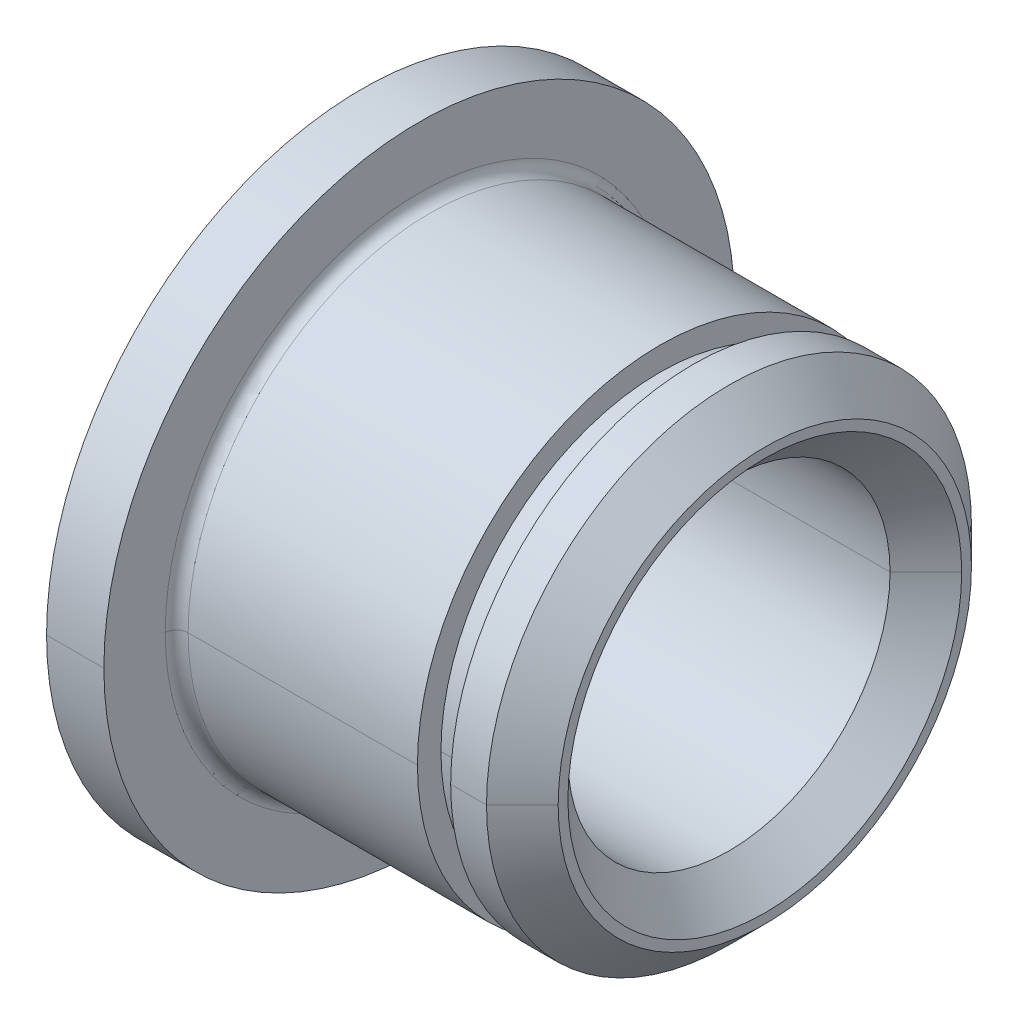
ISO-10303-21;
HEADER;
FILE_DESCRIPTION(('STEP AP214'),'2;1');
FILE_NAME('part.step','',(''),(''),'','','');
FILE_SCHEMA(('AUTOMOTIVE_DESIGN { 1 0 10303 214 1 1 1 1 }'));
ENDSEC;
DATA;
#1=APPLICATION_CONTEXT('core data for automotive mechanical design processes');
#2=APPLICATION_PROTOCOL_DEFINITION('international standard','automotive_design',2000,#1);
#3=PRODUCT_CONTEXT('',#1,'mechanical');
#4=PRODUCT('Part','Part','',(#3));
#5=PRODUCT_RELATED_PRODUCT_CATEGORY('part','',(#4));
#6=PRODUCT_DEFINITION_FORMATION('','',#4);
#7=PRODUCT_DEFINITION_CONTEXT('part definition',#1,'design');
#8=PRODUCT_DEFINITION('design','',#6,#7);
#9=PRODUCT_DEFINITION_SHAPE('','',#8);
#10=(LENGTH_UNIT() NAMED_UNIT(*) SI_UNIT(.MILLI.,.METRE.));
#11=(NAMED_UNIT(*) PLANE_ANGLE_UNIT() SI_UNIT($,.RADIAN.));
#12=(NAMED_UNIT(*) SI_UNIT($,.STERADIAN.) SOLID_ANGLE_UNIT());
#13=UNCERTAINTY_MEASURE_WITH_UNIT(LENGTH_MEASURE(1.E-05),#10,'distance_accuracy_value','');
#14=(GEOMETRIC_REPRESENTATION_CONTEXT(3) GLOBAL_UNCERTAINTY_ASSIGNED_CONTEXT((#13)) GLOBAL_UNIT_ASSIGNED_CONTEXT((#10,
#11,#12)) REPRESENTATION_CONTEXT('',''));
#15=CARTESIAN_POINT('',(0.,0.,0.));
#16=DIRECTION('',(0.,0.,1.));
#17=DIRECTION('',(1.,0.,0.));
#18=AXIS2_PLACEMENT_3D('',#15,#16,#17);
#19=CARTESIAN_POINT('',(0.,4.36245,0.));
#20=DIRECTION('',(1.,0.,0.));
#21=DIRECTION('',(0.,1.,0.));
#22=AXIS2_PLACEMENT_3D('',#19,#20,#21);
#23=PLANE('',#22);
#24=CARTESIAN_POINT('',(0.,0.,0.));
#25=DIRECTION('',(-1.,0.,0.));
#26=DIRECTION('',(0.,0.,1.));
#27=AXIS2_PLACEMENT_3D('',#24,#25,#26);
#28=CIRCLE('',#27,4.36245);
#29=CARTESIAN_POINT('',(0.,0.,4.36245));
#30=VERTEX_POINT('',#29);
#31=CARTESIAN_POINT('',(0.,0.,-4.36245));
#32=VERTEX_POINT('',#31);
#33=EDGE_CURVE('E37',#30,#32,#28,.T.);
#34=ORIENTED_EDGE('',*,*,#33,.F.);
#35=CARTESIAN_POINT('',(0.,0.,0.));
#36=DIRECTION('',(-1.,0.,0.));
#37=DIRECTION('',(0.,0.,1.));
#38=AXIS2_PLACEMENT_3D('',#35,#36,#37);
#39=CIRCLE('',#38,4.36245);
#40=EDGE_CURVE('E235',#32,#30,#39,.T.);
#41=ORIENTED_EDGE('',*,*,#40,.F.);
#42=EDGE_LOOP('',(#34,#41));
#43=FACE_BOUND('',#42,.T.);
#44=CARTESIAN_POINT('',(0.,0.,0.));
#45=DIRECTION('',(-1.,0.,0.));
#46=DIRECTION('',(0.,0.,1.));
#47=AXIS2_PLACEMENT_3D('',#44,#45,#46);
#48=CIRCLE('',#47,6.985);
#49=CARTESIAN_POINT('',(0.,0.,6.985));
#50=VERTEX_POINT('',#49);
#51=CARTESIAN_POINT('',(0.,0.,-6.985));
#52=VERTEX_POINT('',#51);
#53=EDGE_CURVE('E166',#50,#52,#48,.T.);
#54=ORIENTED_EDGE('',*,*,#53,.T.);
#55=CARTESIAN_POINT('',(0.,0.,0.));
#56=DIRECTION('',(-1.,0.,0.));
#57=DIRECTION('',(0.,0.,1.));
#58=AXIS2_PLACEMENT_3D('',#55,#56,#57);
#59=CIRCLE('',#58,6.985);
#60=EDGE_CURVE('E10',#52,#50,#59,.T.);
#61=ORIENTED_EDGE('',*,*,#60,.T.);
#62=EDGE_LOOP('',(#54,#61));
#63=FACE_BOUND('',#62,.T.);
#64=ADVANCED_FACE('F16',(#43,#63),#23,.F.);
#65=CARTESIAN_POINT('',(0.,0.,0.));
#66=DIRECTION('',(-1.,0.,0.));
#67=DIRECTION('',(0.,0.,1.));
#68=AXIS2_PLACEMENT_3D('',#65,#66,#67);
#69=CYLINDRICAL_SURFACE('',#68,6.985);
#70=DIRECTION('',(-1.,0.,0.));
#71=VECTOR('',#70,1.);
#72=CARTESIAN_POINT('',(0.,0.,-6.985));
#73=LINE('',#72,#71);
#74=CARTESIAN_POINT('',(1.27,0.,-6.985));
#75=VERTEX_POINT('',#74);
#76=EDGE_CURVE('E156',#75,#52,#73,.T.);
#77=ORIENTED_EDGE('',*,*,#76,.F.);
#78=CARTESIAN_POINT('',(1.27,0.,0.));
#79=DIRECTION('',(-1.,0.,0.));
#80=DIRECTION('',(0.,0.,1.));
#81=AXIS2_PLACEMENT_3D('',#78,#79,#80);
#82=CIRCLE('',#81,6.985);
#83=CARTESIAN_POINT('',(1.27,0.,6.985));
#84=VERTEX_POINT('',#83);
#85=EDGE_CURVE('E25',#75,#84,#82,.T.);
#86=ORIENTED_EDGE('',*,*,#85,.T.);
#87=DIRECTION('',(-1.,0.,0.));
#88=VECTOR('',#87,1.);
#89=CARTESIAN_POINT('',(0.,0.,6.985));
#90=LINE('',#89,#88);
#91=EDGE_CURVE('E153',#84,#50,#90,.T.);
#92=ORIENTED_EDGE('',*,*,#91,.T.);
#93=ORIENTED_EDGE('',*,*,#60,.F.);
#94=EDGE_LOOP('',(#77,#86,#92,#93));
#95=FACE_BOUND('',#94,.T.);
#96=ADVANCED_FACE('F18',(#95),#69,.T.);
#97=CARTESIAN_POINT('',(1.27,6.985,0.));
#98=DIRECTION('',(-1.,0.,0.));
#99=DIRECTION('',(0.,0.,1.));
#100=AXIS2_PLACEMENT_3D('',#97,#98,#99);
#101=PLANE('',#100);
#102=CARTESIAN_POINT('',(1.27,0.,0.));
#103=DIRECTION('',(-1.,0.,0.));
#104=DIRECTION('',(0.,0.,1.));
#105=AXIS2_PLACEMENT_3D('',#102,#103,#104);
#106=CIRCLE('',#105,5.6261);
#107=CARTESIAN_POINT('',(1.27,0.,5.6261));
#108=VERTEX_POINT('',#107);
#109=CARTESIAN_POINT('',(1.27,0.,-5.6261));
#110=VERTEX_POINT('',#109);
#111=EDGE_CURVE('E161',#108,#110,#106,.T.);
#112=ORIENTED_EDGE('',*,*,#111,.T.);
#113=CARTESIAN_POINT('',(1.27,0.,0.));
#114=DIRECTION('',(-1.,0.,0.));
#115=DIRECTION('',(0.,0.,1.));
#116=AXIS2_PLACEMENT_3D('',#113,#114,#115);
#117=CIRCLE('',#116,5.6261);
#118=EDGE_CURVE('E168',#110,#108,#117,.T.);
#119=ORIENTED_EDGE('',*,*,#118,.T.);
#120=EDGE_LOOP('',(#112,#119));
#121=FACE_BOUND('',#120,.T.);
#122=CARTESIAN_POINT('',(1.27,0.,0.));
#123=DIRECTION('',(-1.,0.,0.));
#124=DIRECTION('',(0.,0.,1.));
#125=AXIS2_PLACEMENT_3D('',#122,#123,#124);
#126=CIRCLE('',#125,6.985);
#127=EDGE_CURVE('E164',#84,#75,#126,.T.);
#128=ORIENTED_EDGE('',*,*,#127,.F.);
#129=ORIENTED_EDGE('',*,*,#85,.F.);
#130=EDGE_LOOP('',(#128,#129));
#131=FACE_BOUND('',#130,.T.);
#132=ADVANCED_FACE('F170',(#121,#131),#101,.F.);
#133=CARTESIAN_POINT('',(1.524,0.,0.));
#134=DIRECTION('',(-1.,0.,0.));
#135=DIRECTION('',(0.,0.,1.));
#136=AXIS2_PLACEMENT_3D('',#133,#134,#135);
#137=TOROIDAL_SURFACE('',#136,5.6261,0.254);
#138=CARTESIAN_POINT('',(1.524,0.,-5.6261));
#139=DIRECTION('',(0.,1.,0.));
#140=DIRECTION('',(0.,0.,1.));
#141=AXIS2_PLACEMENT_3D('',#138,#139,#140);
#142=CIRCLE('',#141,0.254);
#143=CARTESIAN_POINT('',(1.524,0.,-5.3721));
#144=VERTEX_POINT('',#143);
#145=EDGE_CURVE('E181',#110,#144,#142,.T.);
#146=ORIENTED_EDGE('',*,*,#145,.F.);
#147=ORIENTED_EDGE('',*,*,#111,.F.);
#148=CARTESIAN_POINT('',(1.524,0.,5.6261));
#149=DIRECTION('',(0.,-1.,0.));
#150=DIRECTION('',(0.,0.,-1.));
#151=AXIS2_PLACEMENT_3D('',#148,#149,#150);
#152=CIRCLE('',#151,0.254);
#153=CARTESIAN_POINT('',(1.524,0.,5.3721));
#154=VERTEX_POINT('',#153);
#155=EDGE_CURVE('E202',#108,#154,#152,.T.);
#156=ORIENTED_EDGE('',*,*,#155,.T.);
#157=CARTESIAN_POINT('',(1.524,0.,0.));
#158=DIRECTION('',(-1.,0.,0.));
#159=DIRECTION('',(0.,0.,1.));
#160=AXIS2_PLACEMENT_3D('',#157,#158,#159);
#161=CIRCLE('',#160,5.3721);
#162=EDGE_CURVE('E224',#154,#144,#161,.T.);
#163=ORIENTED_EDGE('',*,*,#162,.T.);
#164=EDGE_LOOP('',(#146,#147,#156,#163));
#165=FACE_BOUND('',#164,.T.);
#166=ADVANCED_FACE('F329',(#165),#137,.F.);
#167=CARTESIAN_POINT('',(0.,0.,0.));
#168=DIRECTION('',(-1.,0.,0.));
#169=DIRECTION('',(0.,0.,1.));
#170=AXIS2_PLACEMENT_3D('',#167,#168,#169);
#171=CYLINDRICAL_SURFACE('',#170,5.3721);
#172=DIRECTION('',(-1.,0.,0.));
#173=VECTOR('',#172,1.);
#174=CARTESIAN_POINT('',(0.,0.,-5.3721));
#175=LINE('',#174,#173);
#176=CARTESIAN_POINT('',(6.604,0.,-5.3721));
#177=VERTEX_POINT('',#176);
#178=EDGE_CURVE('E214',#177,#144,#175,.T.);
#179=ORIENTED_EDGE('',*,*,#178,.F.);
#180=CARTESIAN_POINT('',(6.604,0.,0.));
#181=DIRECTION('',(-1.,0.,0.));
#182=DIRECTION('',(0.,0.,1.));
#183=AXIS2_PLACEMENT_3D('',#180,#181,#182);
#184=CIRCLE('',#183,5.3721);
#185=CARTESIAN_POINT('',(6.604,0.,5.3721));
#186=VERTEX_POINT('',#185);
#187=EDGE_CURVE('E318',#177,#186,#184,.T.);
#188=ORIENTED_EDGE('',*,*,#187,.T.);
#189=DIRECTION('',(-1.,0.,0.));
#190=VECTOR('',#189,1.);
#191=CARTESIAN_POINT('',(0.,0.,5.3721));
#192=LINE('',#191,#190);
#193=EDGE_CURVE('E229',#186,#154,#192,.T.);
#194=ORIENTED_EDGE('',*,*,#193,.T.);
#195=CARTESIAN_POINT('',(1.524,0.,0.));
#196=DIRECTION('',(-1.,0.,0.));
#197=DIRECTION('',(0.,0.,1.));
#198=AXIS2_PLACEMENT_3D('',#195,#196,#197);
#199=CIRCLE('',#198,5.3721);
#200=EDGE_CURVE('E187',#144,#154,#199,.T.);
#201=ORIENTED_EDGE('',*,*,#200,.F.);
#202=EDGE_LOOP('',(#179,#188,#194,#201));
#203=FACE_BOUND('',#202,.T.);
#204=ADVANCED_FACE('F336',(#203),#171,.T.);
#205=CARTESIAN_POINT('',(6.604,5.3721,0.));
#206=DIRECTION('',(-1.,0.,0.));
#207=DIRECTION('',(0.,0.,1.));
#208=AXIS2_PLACEMENT_3D('',#205,#206,#207);
#209=PLANE('',#208);
#210=CARTESIAN_POINT('',(6.604,0.,0.));
#211=DIRECTION('',(-1.,0.,0.));
#212=DIRECTION('',(0.,0.,1.));
#213=AXIS2_PLACEMENT_3D('',#210,#211,#212);
#214=CIRCLE('',#213,4.8514);
#215=CARTESIAN_POINT('',(6.604,0.,4.8514));
#216=VERTEX_POINT('',#215);
#217=CARTESIAN_POINT('',(6.604,0.,-4.8514));
#218=VERTEX_POINT('',#217);
#219=EDGE_CURVE('E193',#216,#218,#214,.T.);
#220=ORIENTED_EDGE('',*,*,#219,.T.);
#221=CARTESIAN_POINT('',(6.604,0.,0.));
#222=DIRECTION('',(-1.,0.,0.));
#223=DIRECTION('',(0.,0.,1.));
#224=AXIS2_PLACEMENT_3D('',#221,#222,#223);
#225=CIRCLE('',#224,4.8514);
#226=EDGE_CURVE('E197',#218,#216,#225,.T.);
#227=ORIENTED_EDGE('',*,*,#226,.T.);
#228=EDGE_LOOP('',(#220,#227));
#229=FACE_BOUND('',#228,.T.);
#230=CARTESIAN_POINT('',(6.604,0.,0.));
#231=DIRECTION('',(-1.,0.,0.));
#232=DIRECTION('',(0.,0.,1.));
#233=AXIS2_PLACEMENT_3D('',#230,#231,#232);
#234=CIRCLE('',#233,5.3721);
#235=EDGE_CURVE('E206',#186,#177,#234,.T.);
#236=ORIENTED_EDGE('',*,*,#235,.F.);
#237=ORIENTED_EDGE('',*,*,#187,.F.);
#238=EDGE_LOOP('',(#236,#237));
#239=FACE_BOUND('',#238,.T.);
#240=ADVANCED_FACE('F342',(#229,#239),#209,.F.);
#241=CARTESIAN_POINT('',(0.,0.,0.));
#242=DIRECTION('',(-1.,0.,0.));
#243=DIRECTION('',(0.,0.,1.));
#244=AXIS2_PLACEMENT_3D('',#241,#242,#243);
#245=CYLINDRICAL_SURFACE('',#244,4.8514);
#246=DIRECTION('',(-1.,0.,0.));
#247=VECTOR('',#246,1.);
#248=CARTESIAN_POINT('',(0.,0.,-4.8514));
#249=LINE('',#248,#247);
#250=CARTESIAN_POINT('',(7.3406,0.,-4.8514));
#251=VERTEX_POINT('',#250);
#252=EDGE_CURVE('E210',#251,#218,#249,.T.);
#253=ORIENTED_EDGE('',*,*,#252,.F.);
#254=CARTESIAN_POINT('',(7.3406,0.,0.));
#255=DIRECTION('',(-1.,0.,0.));
#256=DIRECTION('',(0.,0.,1.));
#257=AXIS2_PLACEMENT_3D('',#254,#255,#256);
#258=CIRCLE('',#257,4.8514);
#259=CARTESIAN_POINT('',(7.3406,0.,4.8514));
#260=VERTEX_POINT('',#259);
#261=EDGE_CURVE('E194',#251,#260,#258,.T.);
#262=ORIENTED_EDGE('',*,*,#261,.T.);
#263=DIRECTION('',(-1.,0.,0.));
#264=VECTOR('',#263,1.);
#265=CARTESIAN_POINT('',(0.,0.,4.8514));
#266=LINE('',#265,#264);
#267=EDGE_CURVE('E188',#260,#216,#266,.T.);
#268=ORIENTED_EDGE('',*,*,#267,.T.);
#269=ORIENTED_EDGE('',*,*,#226,.F.);
#270=EDGE_LOOP('',(#253,#262,#268,#269));
#271=FACE_BOUND('',#270,.T.);
#272=ADVANCED_FACE('F344',(#271),#245,.T.);
#273=CARTESIAN_POINT('',(7.3406,4.8514,0.));
#274=DIRECTION('',(1.,0.,0.));
#275=DIRECTION('',(0.,1.,0.));
#276=AXIS2_PLACEMENT_3D('',#273,#274,#275);
#277=PLANE('',#276);
#278=CARTESIAN_POINT('',(7.3406,0.,0.));
#279=DIRECTION('',(-1.,0.,0.));
#280=DIRECTION('',(0.,0.,1.));
#281=AXIS2_PLACEMENT_3D('',#278,#279,#280);
#282=CIRCLE('',#281,4.8514);
#283=EDGE_CURVE('E232',#260,#251,#282,.T.);
#284=ORIENTED_EDGE('',*,*,#283,.F.);
#285=ORIENTED_EDGE('',*,*,#261,.F.);
#286=EDGE_LOOP('',(#284,#285));
#287=FACE_BOUND('',#286,.T.);
#288=CARTESIAN_POINT('',(7.3406,0.,0.));
#289=DIRECTION('',(-1.,0.,0.));
#290=DIRECTION('',(0.,0.,1.));
#291=AXIS2_PLACEMENT_3D('',#288,#289,#290);
#292=CIRCLE('',#291,5.3721);
#293=CARTESIAN_POINT('',(7.3406,0.,5.3721));
#294=VERTEX_POINT('',#293);
#295=CARTESIAN_POINT('',(7.3406,0.,-5.3721));
#296=VERTEX_POINT('',#295);
#297=EDGE_CURVE('E259',#294,#296,#292,.T.);
#298=ORIENTED_EDGE('',*,*,#297,.T.);
#299=CARTESIAN_POINT('',(7.3406,0.,0.));
#300=DIRECTION('',(-1.,0.,0.));
#301=DIRECTION('',(0.,0.,1.));
#302=AXIS2_PLACEMENT_3D('',#299,#300,#301);
#303=CIRCLE('',#302,5.3721);
#304=EDGE_CURVE('E198',#296,#294,#303,.T.);
#305=ORIENTED_EDGE('',*,*,#304,.T.);
#306=EDGE_LOOP('',(#298,#305));
#307=FACE_BOUND('',#306,.T.);
#308=ADVANCED_FACE('F352',(#287,#307),#277,.F.);
#309=CARTESIAN_POINT('',(0.,0.,0.));
#310=DIRECTION('',(-1.,0.,0.));
#311=DIRECTION('',(0.,0.,1.));
#312=AXIS2_PLACEMENT_3D('',#309,#310,#311);
#313=CYLINDRICAL_SURFACE('',#312,5.3721);
#314=DIRECTION('',(-1.,0.,0.));
#315=VECTOR('',#314,1.);
#316=CARTESIAN_POINT('',(0.,0.,-5.3721));
#317=LINE('',#316,#315);
#318=CARTESIAN_POINT('',(8.13435,0.,-5.3721));
#319=VERTEX_POINT('',#318);
#320=EDGE_CURVE('E249',#319,#296,#317,.T.);
#321=ORIENTED_EDGE('',*,*,#320,.F.);
#322=CARTESIAN_POINT('',(8.13435,0.,0.));
#323=DIRECTION('',(-1.,0.,0.));
#324=DIRECTION('',(0.,0.,1.));
#325=AXIS2_PLACEMENT_3D('',#322,#323,#324);
#326=CIRCLE('',#325,5.3721);
#327=CARTESIAN_POINT('',(8.13435,0.,5.3721));
#328=VERTEX_POINT('',#327);
#329=EDGE_CURVE('E311',#319,#328,#326,.T.);
#330=ORIENTED_EDGE('',*,*,#329,.T.);
#331=DIRECTION('',(-1.,0.,0.));
#332=VECTOR('',#331,1.);
#333=CARTESIAN_POINT('',(0.,0.,5.3721));
#334=LINE('',#333,#332);
#335=EDGE_CURVE('E263',#328,#294,#334,.T.);
#336=ORIENTED_EDGE('',*,*,#335,.T.);
#337=ORIENTED_EDGE('',*,*,#304,.F.);
#338=EDGE_LOOP('',(#321,#330,#336,#337));
#339=FACE_BOUND('',#338,.T.);
#340=ADVANCED_FACE('F384',(#339),#313,.T.);
#341=CARTESIAN_POINT('',(8.9281,0.,0.));
#342=DIRECTION('',(-1.,0.,0.));
#343=DIRECTION('',(0.,0.,1.));
#344=AXIS2_PLACEMENT_3D('',#341,#342,#343);
#345=CONICAL_SURFACE('',#344,4.57835,0.78539816339745);
#346=DIRECTION('',(-0.707106781186546,0.,-0.707106781186549));
#347=VECTOR('',#346,1.);
#348=CARTESIAN_POINT('',(8.9281,0.,-4.57835));
#349=LINE('',#348,#347);
#350=CARTESIAN_POINT('',(8.9281,0.,-4.57835));
#351=VERTEX_POINT('',#350);
#352=EDGE_CURVE('E255',#351,#319,#349,.T.);
#353=ORIENTED_EDGE('',*,*,#352,.F.);
#354=CARTESIAN_POINT('',(8.9281,0.,0.));
#355=DIRECTION('',(-1.,0.,0.));
#356=DIRECTION('',(0.,0.,1.));
#357=AXIS2_PLACEMENT_3D('',#354,#355,#356);
#358=CIRCLE('',#357,4.57835);
#359=CARTESIAN_POINT('',(8.9281,0.,4.57835));
#360=VERTEX_POINT('',#359);
#361=EDGE_CURVE('E308',#351,#360,#358,.T.);
#362=ORIENTED_EDGE('',*,*,#361,.T.);
#363=DIRECTION('',(-0.707106781186546,0.,0.707106781186549));
#364=VECTOR('',#363,1.);
#365=CARTESIAN_POINT('',(8.9281,0.,4.57835));
#366=LINE('',#365,#364);
#367=EDGE_CURVE('E250',#360,#328,#366,.T.);
#368=ORIENTED_EDGE('',*,*,#367,.T.);
#369=ORIENTED_EDGE('',*,*,#329,.F.);
#370=EDGE_LOOP('',(#353,#362,#368,#369));
#371=FACE_BOUND('',#370,.T.);
#372=ADVANCED_FACE('F375',(#371),#345,.T.);
#373=CARTESIAN_POINT('',(8.9281,4.57835,0.));
#374=DIRECTION('',(-1.,0.,0.));
#375=DIRECTION('',(0.,0.,1.));
#376=AXIS2_PLACEMENT_3D('',#373,#374,#375);
#377=PLANE('',#376);
#378=CARTESIAN_POINT('',(8.9281,0.,0.));
#379=DIRECTION('',(-1.,0.,0.));
#380=DIRECTION('',(0.,0.,1.));
#381=AXIS2_PLACEMENT_3D('',#378,#379,#380);
#382=CIRCLE('',#381,4.36245);
#383=CARTESIAN_POINT('',(8.9281,0.,-4.36245));
#384=VERTEX_POINT('',#383);
#385=CARTESIAN_POINT('',(8.9281,0.,4.36245));
#386=VERTEX_POINT('',#385);
#387=EDGE_CURVE('E281',#384,#386,#382,.T.);
#388=ORIENTED_EDGE('',*,*,#387,.T.);
#389=CARTESIAN_POINT('',(8.9281,0.,0.));
#390=DIRECTION('',(-1.,0.,0.));
#391=DIRECTION('',(0.,0.,1.));
#392=AXIS2_PLACEMENT_3D('',#389,#390,#391);
#393=CIRCLE('',#392,4.36245);
#394=EDGE_CURVE('E305',#386,#384,#393,.T.);
#395=ORIENTED_EDGE('',*,*,#394,.T.);
#396=EDGE_LOOP('',(#388,#395));
#397=FACE_BOUND('',#396,.T.);
#398=CARTESIAN_POINT('',(8.9281,0.,0.));
#399=DIRECTION('',(-1.,0.,0.));
#400=DIRECTION('',(0.,0.,1.));
#401=AXIS2_PLACEMENT_3D('',#398,#399,#400);
#402=CIRCLE('',#401,4.57835);
#403=EDGE_CURVE('E267',#360,#351,#402,.T.);
#404=ORIENTED_EDGE('',*,*,#403,.F.);
#405=ORIENTED_EDGE('',*,*,#361,.F.);
#406=EDGE_LOOP('',(#404,#405));
#407=FACE_BOUND('',#406,.T.);
#408=ADVANCED_FACE('F371',(#397,#407),#377,.F.);
#409=CARTESIAN_POINT('',(8.13435,0.,0.));
#410=DIRECTION('',(1.,0.,0.));
#411=DIRECTION('',(0.,0.,-1.));
#412=AXIS2_PLACEMENT_3D('',#409,#410,#411);
#413=CONICAL_SURFACE('',#412,3.5687,0.78539816339745);
#414=DIRECTION('',(0.707106781186547,0.,0.707106781186549));
#415=VECTOR('',#414,1.);
#416=CARTESIAN_POINT('',(8.13435,0.,3.5687));
#417=LINE('',#416,#415);
#418=CARTESIAN_POINT('',(8.13435,0.,3.5687));
#419=VERTEX_POINT('',#418);
#420=EDGE_CURVE('E277',#419,#386,#417,.T.);
#421=ORIENTED_EDGE('',*,*,#420,.F.);
#422=CARTESIAN_POINT('',(8.13435,0.,0.));
#423=DIRECTION('',(-1.,0.,0.));
#424=DIRECTION('',(0.,0.,1.));
#425=AXIS2_PLACEMENT_3D('',#422,#423,#424);
#426=CIRCLE('',#425,3.5687);
#427=CARTESIAN_POINT('',(8.13435,0.,-3.5687));
#428=VERTEX_POINT('',#427);
#429=EDGE_CURVE('E302',#419,#428,#426,.T.);
#430=ORIENTED_EDGE('',*,*,#429,.T.);
#431=DIRECTION('',(0.707106781186547,0.,-0.707106781186549));
#432=VECTOR('',#431,1.);
#433=CARTESIAN_POINT('',(8.13435,0.,-3.5687));
#434=LINE('',#433,#432);
#435=EDGE_CURVE('E285',#428,#384,#434,.T.);
#436=ORIENTED_EDGE('',*,*,#435,.T.);
#437=ORIENTED_EDGE('',*,*,#394,.F.);
#438=EDGE_LOOP('',(#421,#430,#436,#437));
#439=FACE_BOUND('',#438,.T.);
#440=ADVANCED_FACE('F374',(#439),#413,.F.);
#441=CARTESIAN_POINT('',(0.,0.,0.));
#442=DIRECTION('',(-1.,0.,0.));
#443=DIRECTION('',(0.,0.,1.));
#444=AXIS2_PLACEMENT_3D('',#441,#442,#443);
#445=CYLINDRICAL_SURFACE('',#444,3.5687);
#446=DIRECTION('',(-1.,0.,0.));
#447=VECTOR('',#446,1.);
#448=CARTESIAN_POINT('',(0.,0.,-3.5687));
#449=LINE('',#448,#447);
#450=CARTESIAN_POINT('',(0.79375,0.,-3.5687));
#451=VERTEX_POINT('',#450);
#452=EDGE_CURVE('E228',#428,#451,#449,.T.);
#453=ORIENTED_EDGE('',*,*,#452,.F.);
#454=ORIENTED_EDGE('',*,*,#429,.F.);
#455=DIRECTION('',(-1.,0.,0.));
#456=VECTOR('',#455,1.);
#457=CARTESIAN_POINT('',(0.,0.,3.5687));
#458=LINE('',#457,#456);
#459=CARTESIAN_POINT('',(0.79375,0.,3.5687));
#460=VERTEX_POINT('',#459);
#461=EDGE_CURVE('E215',#419,#460,#458,.T.);
#462=ORIENTED_EDGE('',*,*,#461,.T.);
#463=CARTESIAN_POINT('',(0.79375,0.,0.));
#464=DIRECTION('',(-1.,0.,0.));
#465=DIRECTION('',(0.,0.,1.));
#466=AXIS2_PLACEMENT_3D('',#463,#464,#465);
#467=CIRCLE('',#466,3.5687);
#468=EDGE_CURVE('E297',#460,#451,#467,.T.);
#469=ORIENTED_EDGE('',*,*,#468,.T.);
#470=EDGE_LOOP('',(#453,#454,#462,#469));
#471=FACE_BOUND('',#470,.T.);
#472=ADVANCED_FACE('F370',(#471),#445,.F.);
#473=CARTESIAN_POINT('',(0.,0.,0.));
#474=DIRECTION('',(-1.,0.,0.));
#475=DIRECTION('',(0.,0.,1.));
#476=AXIS2_PLACEMENT_3D('',#473,#474,#475);
#477=CONICAL_SURFACE('',#476,4.36245,0.785398163397449);
#478=DIRECTION('',(-0.707106781186547,0.,-0.707106781186548));
#479=VECTOR('',#478,1.);
#480=CARTESIAN_POINT('',(0.,0.,-4.36245));
#481=LINE('',#480,#479);
#482=EDGE_CURVE('E219',#451,#32,#481,.T.);
#483=ORIENTED_EDGE('',*,*,#482,.F.);
#484=ORIENTED_EDGE('',*,*,#468,.F.);
#485=DIRECTION('',(-0.707106781186547,0.,0.707106781186548));
#486=VECTOR('',#485,1.);
#487=CARTESIAN_POINT('',(0.,0.,4.36245));
#488=LINE('',#487,#486);
#489=EDGE_CURVE('E239',#460,#30,#488,.T.);
#490=ORIENTED_EDGE('',*,*,#489,.T.);
#491=ORIENTED_EDGE('',*,*,#33,.T.);
#492=EDGE_LOOP('',(#483,#484,#490,#491));
#493=FACE_BOUND('',#492,.T.);
#494=ADVANCED_FACE('F366',(#493),#477,.F.);
#495=CARTESIAN_POINT('',(0.,0.,0.));
#496=DIRECTION('',(-1.,0.,0.));
#497=DIRECTION('',(0.,0.,1.));
#498=AXIS2_PLACEMENT_3D('',#495,#496,#497);
#499=CONICAL_SURFACE('',#498,4.36245,0.785398163397449);
#500=CARTESIAN_POINT('',(0.79375,0.,0.));
#501=DIRECTION('',(-1.,0.,0.));
#502=DIRECTION('',(0.,0.,1.));
#503=AXIS2_PLACEMENT_3D('',#500,#501,#502);
#504=CIRCLE('',#503,3.5687);
#505=EDGE_CURVE('E220',#451,#460,#504,.T.);
#506=ORIENTED_EDGE('',*,*,#505,.F.);
#507=ORIENTED_EDGE('',*,*,#482,.T.);
#508=ORIENTED_EDGE('',*,*,#40,.T.);
#509=ORIENTED_EDGE('',*,*,#489,.F.);
#510=EDGE_LOOP('',(#506,#507,#508,#509));
#511=FACE_BOUND('',#510,.T.);
#512=ADVANCED_FACE('F369',(#511),#499,.F.);
#513=CARTESIAN_POINT('',(0.,0.,0.));
#514=DIRECTION('',(-1.,0.,0.));
#515=DIRECTION('',(0.,0.,1.));
#516=AXIS2_PLACEMENT_3D('',#513,#514,#515);
#517=CYLINDRICAL_SURFACE('',#516,3.5687);
#518=CARTESIAN_POINT('',(8.13435,0.,0.));
#519=DIRECTION('',(-1.,0.,0.));
#520=DIRECTION('',(0.,0.,1.));
#521=AXIS2_PLACEMENT_3D('',#518,#519,#520);
#522=CIRCLE('',#521,3.5687);
#523=EDGE_CURVE('E254',#428,#419,#522,.T.);
#524=ORIENTED_EDGE('',*,*,#523,.F.);
#525=ORIENTED_EDGE('',*,*,#452,.T.);
#526=ORIENTED_EDGE('',*,*,#505,.T.);
#527=ORIENTED_EDGE('',*,*,#461,.F.);
#528=EDGE_LOOP('',(#524,#525,#526,#527));
#529=FACE_BOUND('',#528,.T.);
#530=ADVANCED_FACE('F364',(#529),#517,.F.);
#531=CARTESIAN_POINT('',(8.13435,0.,0.));
#532=DIRECTION('',(1.,0.,0.));
#533=DIRECTION('',(0.,0.,-1.));
#534=AXIS2_PLACEMENT_3D('',#531,#532,#533);
#535=CONICAL_SURFACE('',#534,3.5687,0.78539816339745);
#536=ORIENTED_EDGE('',*,*,#523,.T.);
#537=ORIENTED_EDGE('',*,*,#420,.T.);
#538=ORIENTED_EDGE('',*,*,#387,.F.);
#539=ORIENTED_EDGE('',*,*,#435,.F.);
#540=EDGE_LOOP('',(#536,#537,#538,#539));
#541=FACE_BOUND('',#540,.T.);
#542=ADVANCED_FACE('F423',(#541),#535,.F.);
#543=CARTESIAN_POINT('',(8.9281,0.,0.));
#544=DIRECTION('',(-1.,0.,0.));
#545=DIRECTION('',(0.,0.,1.));
#546=AXIS2_PLACEMENT_3D('',#543,#544,#545);
#547=CONICAL_SURFACE('',#546,4.57835,0.78539816339745);
#548=ORIENTED_EDGE('',*,*,#403,.T.);
#549=ORIENTED_EDGE('',*,*,#352,.T.);
#550=CARTESIAN_POINT('',(8.13435,0.,0.));
#551=DIRECTION('',(-1.,0.,0.));
#552=DIRECTION('',(0.,0.,1.));
#553=AXIS2_PLACEMENT_3D('',#550,#551,#552);
#554=CIRCLE('',#553,5.3721);
#555=EDGE_CURVE('E192',#328,#319,#554,.T.);
#556=ORIENTED_EDGE('',*,*,#555,.F.);
#557=ORIENTED_EDGE('',*,*,#367,.F.);
#558=EDGE_LOOP('',(#548,#549,#556,#557));
#559=FACE_BOUND('',#558,.T.);
#560=ADVANCED_FACE('F397',(#559),#547,.T.);
#561=CARTESIAN_POINT('',(0.,0.,0.));
#562=DIRECTION('',(-1.,0.,0.));
#563=DIRECTION('',(0.,0.,1.));
#564=AXIS2_PLACEMENT_3D('',#561,#562,#563);
#565=CYLINDRICAL_SURFACE('',#564,5.3721);
#566=ORIENTED_EDGE('',*,*,#555,.T.);
#567=ORIENTED_EDGE('',*,*,#320,.T.);
#568=ORIENTED_EDGE('',*,*,#297,.F.);
#569=ORIENTED_EDGE('',*,*,#335,.F.);
#570=EDGE_LOOP('',(#566,#567,#568,#569));
#571=FACE_BOUND('',#570,.T.);
#572=ADVANCED_FACE('F402',(#571),#565,.T.);
#573=CARTESIAN_POINT('',(0.,0.,0.));
#574=DIRECTION('',(-1.,0.,0.));
#575=DIRECTION('',(0.,0.,1.));
#576=AXIS2_PLACEMENT_3D('',#573,#574,#575);
#577=CYLINDRICAL_SURFACE('',#576,4.8514);
#578=ORIENTED_EDGE('',*,*,#283,.T.);
#579=ORIENTED_EDGE('',*,*,#252,.T.);
#580=ORIENTED_EDGE('',*,*,#219,.F.);
#581=ORIENTED_EDGE('',*,*,#267,.F.);
#582=EDGE_LOOP('',(#578,#579,#580,#581));
#583=FACE_BOUND('',#582,.T.);
#584=ADVANCED_FACE('F415',(#583),#577,.T.);
#585=CARTESIAN_POINT('',(0.,0.,0.));
#586=DIRECTION('',(-1.,0.,0.));
#587=DIRECTION('',(0.,0.,1.));
#588=AXIS2_PLACEMENT_3D('',#585,#586,#587);
#589=CYLINDRICAL_SURFACE('',#588,5.3721);
#590=ORIENTED_EDGE('',*,*,#235,.T.);
#591=ORIENTED_EDGE('',*,*,#178,.T.);
#592=ORIENTED_EDGE('',*,*,#162,.F.);
#593=ORIENTED_EDGE('',*,*,#193,.F.);
#594=EDGE_LOOP('',(#590,#591,#592,#593));
#595=FACE_BOUND('',#594,.T.);
#596=ADVANCED_FACE('F340',(#595),#589,.T.);
#597=CARTESIAN_POINT('',(1.524,0.,0.));
#598=DIRECTION('',(-1.,0.,0.));
#599=DIRECTION('',(0.,0.,1.));
#600=AXIS2_PLACEMENT_3D('',#597,#598,#599);
#601=TOROIDAL_SURFACE('',#600,5.6261,0.254);
#602=ORIENTED_EDGE('',*,*,#118,.F.);
#603=ORIENTED_EDGE('',*,*,#145,.T.);
#604=ORIENTED_EDGE('',*,*,#200,.T.);
#605=ORIENTED_EDGE('',*,*,#155,.F.);
#606=EDGE_LOOP('',(#602,#603,#604,#605));
#607=FACE_BOUND('',#606,.T.);
#608=ADVANCED_FACE('F332',(#607),#601,.F.);
#609=CARTESIAN_POINT('',(0.,0.,0.));
#610=DIRECTION('',(-1.,0.,0.));
#611=DIRECTION('',(0.,0.,1.));
#612=AXIS2_PLACEMENT_3D('',#609,#610,#611);
#613=CYLINDRICAL_SURFACE('',#612,6.985);
#614=ORIENTED_EDGE('',*,*,#127,.T.);
#615=ORIENTED_EDGE('',*,*,#76,.T.);
#616=ORIENTED_EDGE('',*,*,#53,.F.);
#617=ORIENTED_EDGE('',*,*,#91,.F.);
#618=EDGE_LOOP('',(#614,#615,#616,#617));
#619=FACE_BOUND('',#618,.T.);
#620=ADVANCED_FACE('F163',(#619),#613,.T.);
#621=CLOSED_SHELL('',(#64,#96,#132,#166,#204,#240,#272,#308,#340,#372,#408,#440,#472,#494,#512,
#530,#542,#560,#572,#584,#596,#608,#620));
#622=MANIFOLD_SOLID_BREP('B1',#621);
#623=ADVANCED_BREP_SHAPE_REPRESENTATION('',(#18,#622),#14);
#624=SHAPE_DEFINITION_REPRESENTATION(#9,#623);
ENDSEC;
END-ISO-10303-21;
